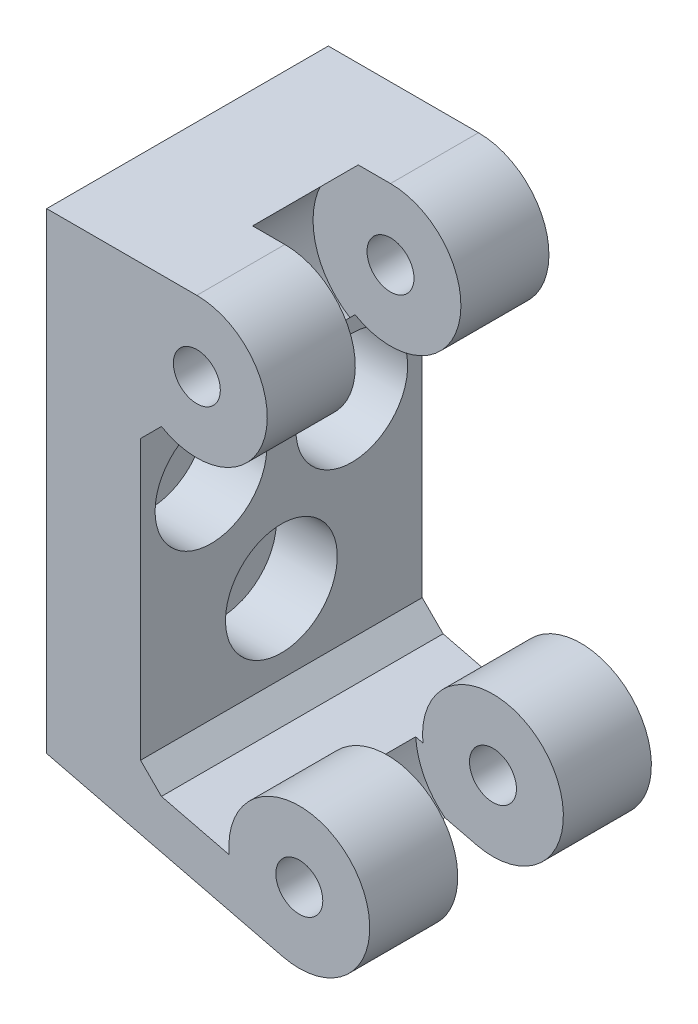
ISO-10303-21;
HEADER;
FILE_DESCRIPTION(('STEP AP214'),'2;1');
FILE_NAME('part.step','',(''),(''),'','','');
FILE_SCHEMA(('AUTOMOTIVE_DESIGN { 1 0 10303 214 1 1 1 1 }'));
ENDSEC;
DATA;
#1=APPLICATION_CONTEXT('core data for automotive mechanical design processes');
#2=APPLICATION_PROTOCOL_DEFINITION('international standard','automotive_design',2000,#1);
#3=PRODUCT_CONTEXT('',#1,'mechanical');
#4=PRODUCT('Part','Part','',(#3));
#5=PRODUCT_RELATED_PRODUCT_CATEGORY('part','',(#4));
#6=PRODUCT_DEFINITION_FORMATION('','',#4);
#7=PRODUCT_DEFINITION_CONTEXT('part definition',#1,'design');
#8=PRODUCT_DEFINITION('design','',#6,#7);
#9=PRODUCT_DEFINITION_SHAPE('','',#8);
#10=(LENGTH_UNIT() NAMED_UNIT(*) SI_UNIT(.MILLI.,.METRE.));
#11=(NAMED_UNIT(*) PLANE_ANGLE_UNIT() SI_UNIT($,.RADIAN.));
#12=(NAMED_UNIT(*) SI_UNIT($,.STERADIAN.) SOLID_ANGLE_UNIT());
#13=UNCERTAINTY_MEASURE_WITH_UNIT(LENGTH_MEASURE(1.E-05),#10,'distance_accuracy_value','');
#14=(GEOMETRIC_REPRESENTATION_CONTEXT(3) GLOBAL_UNCERTAINTY_ASSIGNED_CONTEXT((#13)) GLOBAL_UNIT_ASSIGNED_CONTEXT((#10,
#11,#12)) REPRESENTATION_CONTEXT('',''));
#15=CARTESIAN_POINT('',(0.,0.,0.));
#16=DIRECTION('',(0.,0.,1.));
#17=DIRECTION('',(1.,0.,0.));
#18=AXIS2_PLACEMENT_3D('',#15,#16,#17);
#19=CARTESIAN_POINT('',(10.7639891563292,0.450749356497164,12.));
#20=DIRECTION('',(0.,0.,-1.));
#21=DIRECTION('',(-1.,0.,0.));
#22=AXIS2_PLACEMENT_3D('',#19,#20,#21);
#23=CYLINDRICAL_SURFACE('',#22,2.99999999999828);
#24=CARTESIAN_POINT('',(10.7639891563292,0.450749356497164,3.75));
#25=DIRECTION('',(0.,0.,1.));
#26=DIRECTION('',(1.,0.,0.));
#27=AXIS2_PLACEMENT_3D('',#24,#25,#26);
#28=CIRCLE('',#27,2.99999999999828);
#29=CARTESIAN_POINT('',(10.0498839975079,-2.46302033621104,3.75));
#30=VERTEX_POINT('',#29);
#31=CARTESIAN_POINT('',(7.77882569201746,0.152757592638008,3.75));
#32=VERTEX_POINT('',#31);
#33=EDGE_CURVE('E157',#30,#32,#28,.T.);
#34=ORIENTED_EDGE('',*,*,#33,.F.);
#35=DIRECTION('',(0.,0.,-1.));
#36=VECTOR('',#35,1.);
#37=CARTESIAN_POINT('',(10.0498839975079,-2.46302033621104,12.));
#38=LINE('',#37,#36);
#39=CARTESIAN_POINT('',(10.0498839975079,-2.46302033621104,0.));
#40=VERTEX_POINT('',#39);
#41=EDGE_CURVE('E219',#30,#40,#38,.T.);
#42=ORIENTED_EDGE('',*,*,#41,.T.);
#43=CARTESIAN_POINT('',(10.7639891563292,0.450749356497164,0.));
#44=DIRECTION('',(0.,0.,1.));
#45=DIRECTION('',(1.,0.,0.));
#46=AXIS2_PLACEMENT_3D('',#43,#44,#45);
#47=CIRCLE('',#46,2.99999999999828);
#48=CARTESIAN_POINT('',(7.77882569201917,0.152757592638178,0.));
#49=VERTEX_POINT('',#48);
#50=EDGE_CURVE('E196',#40,#49,#47,.T.);
#51=ORIENTED_EDGE('',*,*,#50,.T.);
#52=DIRECTION('',(0.,0.,-1.));
#53=VECTOR('',#52,1.);
#54=CARTESIAN_POINT('',(7.77882569201917,0.152757592638178,12.));
#55=LINE('',#54,#53);
#56=EDGE_CURVE('E266',#32,#49,#55,.T.);
#57=ORIENTED_EDGE('',*,*,#56,.F.);
#58=EDGE_LOOP('',(#34,#42,#51,#57));
#59=FACE_BOUND('',#58,.T.);
#60=ADVANCED_FACE('F36',(#59),#23,.T.);
#61=CARTESIAN_POINT('',(6.39891849097926,17.1035086112948,12.));
#62=DIRECTION('',(0.,0.,-1.));
#63=DIRECTION('',(-1.,0.,0.));
#64=AXIS2_PLACEMENT_3D('',#61,#62,#63);
#65=CYLINDRICAL_SURFACE('',#64,2.99999999999656);
#66=CARTESIAN_POINT('',(6.39891849097926,17.1035086112948,3.75));
#67=DIRECTION('',(0.,0.,1.));
#68=DIRECTION('',(1.,0.,0.));
#69=AXIS2_PLACEMENT_3D('',#66,#67,#68);
#70=CIRCLE('',#69,2.99999999999656);
#71=CARTESIAN_POINT('',(4.88959841783995,14.5108356822892,3.75));
#72=VERTEX_POINT('',#71);
#73=CARTESIAN_POINT('',(6.39891849097926,20.1035086112948,3.75));
#74=VERTEX_POINT('',#73);
#75=EDGE_CURVE('E53',#72,#74,#70,.T.);
#76=ORIENTED_EDGE('',*,*,#75,.F.);
#77=DIRECTION('',(0.,0.,-1.));
#78=VECTOR('',#77,1.);
#79=CARTESIAN_POINT('',(4.88959841783995,14.5108356822892,12.));
#80=LINE('',#79,#78);
#81=CARTESIAN_POINT('',(4.88959841783995,14.5108356822892,0.));
#82=VERTEX_POINT('',#81);
#83=EDGE_CURVE('E253',#72,#82,#80,.T.);
#84=ORIENTED_EDGE('',*,*,#83,.T.);
#85=CARTESIAN_POINT('',(6.39891849097926,17.1035086112948,0.));
#86=DIRECTION('',(0.,0.,1.));
#87=DIRECTION('',(-1.,0.,0.));
#88=AXIS2_PLACEMENT_3D('',#85,#86,#87);
#89=CIRCLE('',#88,2.99999999999656);
#90=CARTESIAN_POINT('',(6.39891849097926,20.1035086112948,0.));
#91=VERTEX_POINT('',#90);
#92=EDGE_CURVE('E231',#82,#91,#89,.T.);
#93=ORIENTED_EDGE('',*,*,#92,.T.);
#94=DIRECTION('',(0.,0.,-1.));
#95=VECTOR('',#94,1.);
#96=CARTESIAN_POINT('',(6.39891849097926,20.1035086112948,12.));
#97=LINE('',#96,#95);
#98=EDGE_CURVE('E249',#74,#91,#97,.T.);
#99=ORIENTED_EDGE('',*,*,#98,.F.);
#100=EDGE_LOOP('',(#76,#84,#93,#99));
#101=FACE_BOUND('',#100,.T.);
#102=ADVANCED_FACE('F356',(#101),#65,.T.);
#103=CARTESIAN_POINT('',(6.39891849097926,17.1035086112948,12.));
#104=DIRECTION('',(0.,0.,-1.));
#105=DIRECTION('',(-1.,0.,0.));
#106=AXIS2_PLACEMENT_3D('',#103,#104,#105);
#107=CYLINDRICAL_SURFACE('',#106,1.00000000000001);
#108=CARTESIAN_POINT('',(6.39891849097926,17.1035086112948,0.));
#109=DIRECTION('',(0.,0.,1.));
#110=DIRECTION('',(1.,0.,0.));
#111=AXIS2_PLACEMENT_3D('',#108,#109,#110);
#112=CIRCLE('',#111,1.00000000000001);
#113=CARTESIAN_POINT('',(7.39891849097927,17.1035086112948,0.));
#114=VERTEX_POINT('',#113);
#115=EDGE_CURVE('E190',#114,#114,#112,.T.);
#116=ORIENTED_EDGE('',*,*,#115,.F.);
#117=EDGE_LOOP('',(#116));
#118=FACE_BOUND('',#117,.T.);
#119=CARTESIAN_POINT('',(6.39891849097926,17.1035086112948,3.75));
#120=DIRECTION('',(0.,0.,1.));
#121=DIRECTION('',(1.,0.,0.));
#122=AXIS2_PLACEMENT_3D('',#119,#120,#121);
#123=CIRCLE('',#122,1.00000000000001);
#124=CARTESIAN_POINT('',(7.39891849097927,17.1035086112948,3.75));
#125=VERTEX_POINT('',#124);
#126=EDGE_CURVE('E277',#125,#125,#123,.T.);
#127=ORIENTED_EDGE('',*,*,#126,.T.);
#128=EDGE_LOOP('',(#127));
#129=FACE_BOUND('',#128,.T.);
#130=ADVANCED_FACE('F405',(#118,#129),#107,.F.);
#131=CARTESIAN_POINT('',(10.7639891563292,0.450749356497164,12.));
#132=DIRECTION('',(0.,0.,-1.));
#133=DIRECTION('',(-1.,0.,0.));
#134=AXIS2_PLACEMENT_3D('',#131,#132,#133);
#135=CYLINDRICAL_SURFACE('',#134,0.999999999999998);
#136=CARTESIAN_POINT('',(10.7639891563292,0.450749356497164,0.));
#137=DIRECTION('',(0.,0.,1.));
#138=DIRECTION('',(1.,0.,0.));
#139=AXIS2_PLACEMENT_3D('',#136,#137,#138);
#140=CIRCLE('',#139,0.999999999999998);
#141=CARTESIAN_POINT('',(11.7639891563292,0.450749356497164,0.));
#142=VERTEX_POINT('',#141);
#143=EDGE_CURVE('E180',#142,#142,#140,.T.);
#144=ORIENTED_EDGE('',*,*,#143,.F.);
#145=EDGE_LOOP('',(#144));
#146=FACE_BOUND('',#145,.T.);
#147=CARTESIAN_POINT('',(10.7639891563292,0.450749356497164,3.75));
#148=DIRECTION('',(0.,0.,1.));
#149=DIRECTION('',(1.,0.,0.));
#150=AXIS2_PLACEMENT_3D('',#147,#148,#149);
#151=CIRCLE('',#150,0.999999999999998);
#152=CARTESIAN_POINT('',(11.7639891563292,0.450749356497164,3.75));
#153=VERTEX_POINT('',#152);
#154=EDGE_CURVE('E269',#153,#153,#151,.T.);
#155=ORIENTED_EDGE('',*,*,#154,.T.);
#156=EDGE_LOOP('',(#155));
#157=FACE_BOUND('',#156,.T.);
#158=ADVANCED_FACE('F416',(#146,#157),#135,.F.);
#159=CARTESIAN_POINT('',(10.7639891563292,0.450749356497164,12.));
#160=DIRECTION('',(0.,0.,1.));
#161=DIRECTION('',(1.,0.,0.));
#162=AXIS2_PLACEMENT_3D('',#159,#160,#161);
#163=PLANE('',#162);
#164=CARTESIAN_POINT('',(6.39891849097926,17.1035086112948,12.));
#165=DIRECTION('',(0.,0.,1.));
#166=DIRECTION('',(1.,0.,0.));
#167=AXIS2_PLACEMENT_3D('',#164,#165,#166);
#168=CIRCLE('',#167,1.00000000000001);
#169=CARTESIAN_POINT('',(7.39891849097927,17.1035086112948,12.));
#170=VERTEX_POINT('',#169);
#171=EDGE_CURVE('E193',#170,#170,#168,.T.);
#172=ORIENTED_EDGE('',*,*,#171,.F.);
#173=EDGE_LOOP('',(#172));
#174=FACE_BOUND('',#173,.T.);
#175=CARTESIAN_POINT('',(10.7639891563292,0.450749356497164,12.));
#176=DIRECTION('',(0.,0.,1.));
#177=DIRECTION('',(1.,0.,0.));
#178=AXIS2_PLACEMENT_3D('',#175,#176,#177);
#179=CIRCLE('',#178,2.99999999999828);
#180=CARTESIAN_POINT('',(10.0498839975079,-2.46302033621104,12.));
#181=VERTEX_POINT('',#180);
#182=CARTESIAN_POINT('',(7.77882569201917,0.152757592638178,12.));
#183=VERTEX_POINT('',#182);
#184=EDGE_CURVE('E199',#181,#183,#179,.T.);
#185=ORIENTED_EDGE('',*,*,#184,.T.);
#186=DIRECTION('',(-0.971256564236068,0.238035052940422,0.));
#187=VECTOR('',#186,1.);
#188=CARTESIAN_POINT('',(4.88959841784168,0.860847908307429,12.));
#189=LINE('',#188,#187);
#190=CARTESIAN_POINT('',(4.88959841784168,0.860847908307429,12.));
#191=VERTEX_POINT('',#190);
#192=EDGE_CURVE('E202',#183,#191,#189,.T.);
#193=ORIENTED_EDGE('',*,*,#192,.T.);
#194=DIRECTION('',(-0.707106781186549,0.707106781186546,0.));
#195=VECTOR('',#194,1.);
#196=CARTESIAN_POINT('',(4.,1.7504463261491,12.));
#197=LINE('',#196,#195);
#198=CARTESIAN_POINT('',(4.,1.7504463261491,12.));
#199=VERTEX_POINT('',#198);
#200=EDGE_CURVE('E205',#191,#199,#197,.T.);
#201=ORIENTED_EDGE('',*,*,#200,.T.);
#202=DIRECTION('',(0.,1.,0.));
#203=VECTOR('',#202,1.);
#204=CARTESIAN_POINT('',(4.,13.6212372644505,12.));
#205=LINE('',#204,#203);
#206=CARTESIAN_POINT('',(4.,13.6212372644505,12.));
#207=VERTEX_POINT('',#206);
#208=EDGE_CURVE('E207',#199,#207,#205,.T.);
#209=ORIENTED_EDGE('',*,*,#208,.T.);
#210=DIRECTION('',(0.707106781186549,0.707106781186546,0.));
#211=VECTOR('',#210,1.);
#212=CARTESIAN_POINT('',(4.88959841784167,14.5108356822922,12.));
#213=LINE('',#212,#211);
#214=CARTESIAN_POINT('',(4.88959841783995,14.5108356822892,12.));
#215=VERTEX_POINT('',#214);
#216=EDGE_CURVE('E209',#207,#215,#213,.T.);
#217=ORIENTED_EDGE('',*,*,#216,.T.);
#218=CARTESIAN_POINT('',(6.39891849097926,17.1035086112948,12.));
#219=DIRECTION('',(0.,0.,1.));
#220=DIRECTION('',(-1.,0.,0.));
#221=AXIS2_PLACEMENT_3D('',#218,#219,#220);
#222=CIRCLE('',#221,2.99999999999656);
#223=CARTESIAN_POINT('',(6.39891849097926,20.1035086112948,12.));
#224=VERTEX_POINT('',#223);
#225=EDGE_CURVE('E211',#215,#224,#222,.T.);
#226=ORIENTED_EDGE('',*,*,#225,.T.);
#227=DIRECTION('',(-1.,0.,0.));
#228=VECTOR('',#227,1.);
#229=CARTESIAN_POINT('',(0.,20.1035086112948,12.));
#230=LINE('',#229,#228);
#231=CARTESIAN_POINT('',(0.,20.1035086112948,12.));
#232=VERTEX_POINT('',#231);
#233=EDGE_CURVE('E213',#224,#232,#230,.T.);
#234=ORIENTED_EDGE('',*,*,#233,.T.);
#235=DIRECTION('',(0.,-1.,0.));
#236=VECTOR('',#235,1.);
#237=CARTESIAN_POINT('',(0.,0.,12.));
#238=LINE('',#237,#236);
#239=CARTESIAN_POINT('',(0.,0.,12.));
#240=VERTEX_POINT('',#239);
#241=EDGE_CURVE('E215',#232,#240,#238,.T.);
#242=ORIENTED_EDGE('',*,*,#241,.T.);
#243=DIRECTION('',(0.971256564236068,-0.238035052940421,0.));
#244=VECTOR('',#243,1.);
#245=CARTESIAN_POINT('',(0.,0.,12.));
#246=LINE('',#245,#244);
#247=EDGE_CURVE('E217',#240,#181,#246,.T.);
#248=ORIENTED_EDGE('',*,*,#247,.T.);
#249=EDGE_LOOP('',(#185,#193,#201,#209,#217,#226,#234,#242,#248));
#250=FACE_BOUND('',#249,.T.);
#251=CARTESIAN_POINT('',(10.7639891563292,0.450749356497164,12.));
#252=DIRECTION('',(0.,0.,1.));
#253=DIRECTION('',(1.,0.,0.));
#254=AXIS2_PLACEMENT_3D('',#251,#252,#253);
#255=CIRCLE('',#254,0.999999999999998);
#256=CARTESIAN_POINT('',(11.7639891563292,0.450749356497164,12.));
#257=VERTEX_POINT('',#256);
#258=EDGE_CURVE('E187',#257,#257,#255,.T.);
#259=ORIENTED_EDGE('',*,*,#258,.F.);
#260=EDGE_LOOP('',(#259));
#261=FACE_BOUND('',#260,.T.);
#262=ADVANCED_FACE('F339',(#174,#250,#261),#163,.T.);
#263=CARTESIAN_POINT('',(10.7639891563292,0.450749356497164,0.));
#264=DIRECTION('',(0.,0.,1.));
#265=DIRECTION('',(1.,0.,0.));
#266=AXIS2_PLACEMENT_3D('',#263,#264,#265);
#267=PLANE('',#266);
#268=ORIENTED_EDGE('',*,*,#50,.F.);
#269=DIRECTION('',(0.971256564236068,-0.238035052940421,0.));
#270=VECTOR('',#269,1.);
#271=CARTESIAN_POINT('',(0.,0.,0.));
#272=LINE('',#271,#270);
#273=CARTESIAN_POINT('',(0.,0.,0.));
#274=VERTEX_POINT('',#273);
#275=EDGE_CURVE('E203',#274,#40,#272,.T.);
#276=ORIENTED_EDGE('',*,*,#275,.F.);
#277=DIRECTION('',(0.,-1.,0.));
#278=VECTOR('',#277,1.);
#279=CARTESIAN_POINT('',(0.,0.,0.));
#280=LINE('',#279,#278);
#281=CARTESIAN_POINT('',(0.,20.1035086112948,0.));
#282=VERTEX_POINT('',#281);
#283=EDGE_CURVE('E236',#282,#274,#280,.T.);
#284=ORIENTED_EDGE('',*,*,#283,.F.);
#285=DIRECTION('',(-1.,0.,0.));
#286=VECTOR('',#285,1.);
#287=CARTESIAN_POINT('',(0.,20.1035086112948,0.));
#288=LINE('',#287,#286);
#289=EDGE_CURVE('E234',#91,#282,#288,.T.);
#290=ORIENTED_EDGE('',*,*,#289,.F.);
#291=ORIENTED_EDGE('',*,*,#92,.F.);
#292=DIRECTION('',(0.707106781186549,0.707106781186546,0.));
#293=VECTOR('',#292,1.);
#294=CARTESIAN_POINT('',(4.88959841784167,14.5108356822922,0.));
#295=LINE('',#294,#293);
#296=CARTESIAN_POINT('',(4.,13.6212372644505,0.));
#297=VERTEX_POINT('',#296);
#298=EDGE_CURVE('E228',#297,#82,#295,.T.);
#299=ORIENTED_EDGE('',*,*,#298,.F.);
#300=DIRECTION('',(0.,1.,0.));
#301=VECTOR('',#300,1.);
#302=CARTESIAN_POINT('',(4.,13.6212372644505,0.));
#303=LINE('',#302,#301);
#304=CARTESIAN_POINT('',(4.,1.7504463261491,0.));
#305=VERTEX_POINT('',#304);
#306=EDGE_CURVE('E226',#305,#297,#303,.T.);
#307=ORIENTED_EDGE('',*,*,#306,.F.);
#308=DIRECTION('',(-0.707106781186549,0.707106781186546,0.));
#309=VECTOR('',#308,1.);
#310=CARTESIAN_POINT('',(4.,1.7504463261491,0.));
#311=LINE('',#310,#309);
#312=CARTESIAN_POINT('',(4.88959841784168,0.860847908307429,0.));
#313=VERTEX_POINT('',#312);
#314=EDGE_CURVE('E224',#313,#305,#311,.T.);
#315=ORIENTED_EDGE('',*,*,#314,.F.);
#316=DIRECTION('',(-0.971256564236068,0.238035052940422,0.));
#317=VECTOR('',#316,1.);
#318=CARTESIAN_POINT('',(4.88959841784168,0.860847908307429,0.));
#319=LINE('',#318,#317);
#320=EDGE_CURVE('E222',#49,#313,#319,.T.);
#321=ORIENTED_EDGE('',*,*,#320,.F.);
#322=EDGE_LOOP('',(#268,#276,#284,#290,#291,#299,#307,#315,#321));
#323=FACE_BOUND('',#322,.T.);
#324=ORIENTED_EDGE('',*,*,#115,.T.);
#325=EDGE_LOOP('',(#324));
#326=FACE_BOUND('',#325,.T.);
#327=ORIENTED_EDGE('',*,*,#143,.T.);
#328=EDGE_LOOP('',(#327));
#329=FACE_BOUND('',#328,.T.);
#330=ADVANCED_FACE('F364',(#323,#326,#329),#267,.F.);
#331=CARTESIAN_POINT('',(10.0498839975079,-2.46302033621104,8.25));
#332=VERTEX_POINT('',#331);
#333=EDGE_CURVE('E240',#181,#332,#38,.T.);
#334=ORIENTED_EDGE('',*,*,#333,.T.);
#335=CARTESIAN_POINT('',(10.7639891563292,0.450749356497164,8.25));
#336=DIRECTION('',(0.,0.,1.));
#337=DIRECTION('',(1.,0.,0.));
#338=AXIS2_PLACEMENT_3D('',#335,#336,#337);
#339=CIRCLE('',#338,2.99999999999828);
#340=CARTESIAN_POINT('',(7.77882569201746,0.152757592638008,8.25));
#341=VERTEX_POINT('',#340);
#342=EDGE_CURVE('E317',#332,#341,#339,.T.);
#343=ORIENTED_EDGE('',*,*,#342,.T.);
#344=EDGE_CURVE('E267',#183,#341,#55,.T.);
#345=ORIENTED_EDGE('',*,*,#344,.F.);
#346=ORIENTED_EDGE('',*,*,#184,.F.);
#347=EDGE_LOOP('',(#334,#343,#345,#346));
#348=FACE_BOUND('',#347,.T.);
#349=ADVANCED_FACE('F38',(#348),#23,.T.);
#350=CARTESIAN_POINT('',(4.88959841784168,0.860847908307429,12.));
#351=DIRECTION('',(-0.238035052940422,-0.971256564236068,0.));
#352=DIRECTION('',(0.971256564236068,-0.238035052940422,0.));
#353=AXIS2_PLACEMENT_3D('',#350,#351,#352);
#354=PLANE('',#353);
#355=ORIENTED_EDGE('',*,*,#344,.T.);
#356=DIRECTION('',(-0.971256564236068,0.238035052940422,0.));
#357=VECTOR('',#356,1.);
#358=CARTESIAN_POINT('',(4.88959841784168,0.860847908307429,8.25));
#359=LINE('',#358,#357);
#360=CARTESIAN_POINT('',(7.47151048609546,0.22807424325869,8.25));
#361=VERTEX_POINT('',#360);
#362=EDGE_CURVE('E176',#341,#361,#359,.T.);
#363=ORIENTED_EDGE('',*,*,#362,.T.);
#364=DIRECTION('',(0.,0.,-1.));
#365=VECTOR('',#364,1.);
#366=CARTESIAN_POINT('',(7.47151048609546,0.22807424325869,8.25));
#367=LINE('',#366,#365);
#368=CARTESIAN_POINT('',(7.47151048609546,0.22807424325869,3.75));
#369=VERTEX_POINT('',#368);
#370=EDGE_CURVE('E166',#369,#361,#367,.F.);
#371=ORIENTED_EDGE('',*,*,#370,.F.);
#372=DIRECTION('',(-0.971256564236068,0.238035052940422,0.));
#373=VECTOR('',#372,1.);
#374=CARTESIAN_POINT('',(4.88959841784168,0.860847908307429,3.75));
#375=LINE('',#374,#373);
#376=EDGE_CURVE('E154',#32,#369,#375,.T.);
#377=ORIENTED_EDGE('',*,*,#376,.F.);
#378=ORIENTED_EDGE('',*,*,#56,.T.);
#379=ORIENTED_EDGE('',*,*,#320,.T.);
#380=DIRECTION('',(0.,0.,-1.));
#381=VECTOR('',#380,1.);
#382=CARTESIAN_POINT('',(4.88959841784168,0.860847908307429,12.));
#383=LINE('',#382,#381);
#384=EDGE_CURVE('E263',#191,#313,#383,.T.);
#385=ORIENTED_EDGE('',*,*,#384,.F.);
#386=ORIENTED_EDGE('',*,*,#192,.F.);
#387=EDGE_LOOP('',(#355,#363,#371,#377,#378,#379,#385,#386));
#388=FACE_BOUND('',#387,.T.);
#389=ADVANCED_FACE('F175',(#388),#354,.F.);
#390=CARTESIAN_POINT('',(4.,1.7504463261491,12.));
#391=DIRECTION('',(-0.707106781186546,-0.707106781186549,0.));
#392=DIRECTION('',(0.707106781186549,-0.707106781186546,0.));
#393=AXIS2_PLACEMENT_3D('',#390,#391,#392);
#394=PLANE('',#393);
#395=ORIENTED_EDGE('',*,*,#314,.T.);
#396=DIRECTION('',(0.,0.,-1.));
#397=VECTOR('',#396,1.);
#398=CARTESIAN_POINT('',(4.,1.7504463261491,12.));
#399=LINE('',#398,#397);
#400=EDGE_CURVE('E260',#199,#305,#399,.T.);
#401=ORIENTED_EDGE('',*,*,#400,.F.);
#402=ORIENTED_EDGE('',*,*,#200,.F.);
#403=ORIENTED_EDGE('',*,*,#384,.T.);
#404=EDGE_LOOP('',(#395,#401,#402,#403));
#405=FACE_BOUND('',#404,.T.);
#406=ADVANCED_FACE('F382',(#405),#394,.F.);
#407=CARTESIAN_POINT('',(4.,13.6212372644505,12.));
#408=DIRECTION('',(-1.,0.,0.));
#409=DIRECTION('',(0.,-1.,0.));
#410=AXIS2_PLACEMENT_3D('',#407,#408,#409);
#411=PLANE('',#410);
#412=CARTESIAN_POINT('',(4.00000000000001,5.08957787179198,6.));
#413=DIRECTION('',(-1.,0.,0.));
#414=DIRECTION('',(0.,0.,1.));
#415=AXIS2_PLACEMENT_3D('',#412,#413,#414);
#416=CIRCLE('',#415,2.38125);
#417=CARTESIAN_POINT('',(4.00000000000001,5.08957787179198,8.38125));
#418=VERTEX_POINT('',#417);
#419=EDGE_CURVE('E748',#418,#418,#416,.T.);
#420=ORIENTED_EDGE('',*,*,#419,.T.);
#421=EDGE_LOOP('',(#420));
#422=FACE_BOUND('',#421,.T.);
#423=CARTESIAN_POINT('',(4.00000000000001,10.6212372644505,9.));
#424=DIRECTION('',(-1.,0.,0.));
#425=DIRECTION('',(0.,0.,1.));
#426=AXIS2_PLACEMENT_3D('',#423,#424,#425);
#427=CIRCLE('',#426,2.38125);
#428=CARTESIAN_POINT('',(4.00000000000001,10.6212372644505,11.38125));
#429=VERTEX_POINT('',#428);
#430=EDGE_CURVE('E749',#429,#429,#427,.T.);
#431=ORIENTED_EDGE('',*,*,#430,.T.);
#432=EDGE_LOOP('',(#431));
#433=FACE_BOUND('',#432,.T.);
#434=CARTESIAN_POINT('',(4.00000000000001,10.6212372644505,3.));
#435=DIRECTION('',(-1.,0.,0.));
#436=DIRECTION('',(0.,0.,1.));
#437=AXIS2_PLACEMENT_3D('',#434,#435,#436);
#438=CIRCLE('',#437,2.38125);
#439=CARTESIAN_POINT('',(4.00000000000001,10.6212372644505,5.38125));
#440=VERTEX_POINT('',#439);
#441=EDGE_CURVE('E758',#440,#440,#438,.T.);
#442=ORIENTED_EDGE('',*,*,#441,.T.);
#443=EDGE_LOOP('',(#442));
#444=FACE_BOUND('',#443,.T.);
#445=ORIENTED_EDGE('',*,*,#306,.T.);
#446=DIRECTION('',(0.,0.,-1.));
#447=VECTOR('',#446,1.);
#448=CARTESIAN_POINT('',(4.,13.6212372644505,12.));
#449=LINE('',#448,#447);
#450=EDGE_CURVE('E257',#207,#297,#449,.T.);
#451=ORIENTED_EDGE('',*,*,#450,.F.);
#452=ORIENTED_EDGE('',*,*,#208,.F.);
#453=ORIENTED_EDGE('',*,*,#400,.T.);
#454=EDGE_LOOP('',(#445,#451,#452,#453));
#455=FACE_BOUND('',#454,.T.);
#456=ADVANCED_FACE('F385',(#422,#433,#444,#455),#411,.F.);
#457=CARTESIAN_POINT('',(4.88959841784167,14.5108356822922,12.));
#458=DIRECTION('',(-0.707106781186546,0.707106781186549,0.));
#459=DIRECTION('',(-0.707106781186549,-0.707106781186546,0.));
#460=AXIS2_PLACEMENT_3D('',#457,#458,#459);
#461=PLANE('',#460);
#462=DIRECTION('',(0.,0.,-1.));
#463=VECTOR('',#462,1.);
#464=CARTESIAN_POINT('',(4.6708842220558,14.2921214865063,8.25));
#465=LINE('',#464,#463);
#466=CARTESIAN_POINT('',(4.6708842220558,14.2921214865063,8.25));
#467=VERTEX_POINT('',#466);
#468=CARTESIAN_POINT('',(4.6708842220558,14.2921214865063,3.75));
#469=VERTEX_POINT('',#468);
#470=EDGE_CURVE('E177',#467,#469,#465,.T.);
#471=ORIENTED_EDGE('',*,*,#470,.F.);
#472=DIRECTION('',(0.707106781186549,0.707106781186546,0.));
#473=VECTOR('',#472,1.);
#474=CARTESIAN_POINT('',(4.88959841784167,14.5108356822922,8.25));
#475=LINE('',#474,#473);
#476=CARTESIAN_POINT('',(4.88959841783995,14.5108356822892,8.25));
#477=VERTEX_POINT('',#476);
#478=EDGE_CURVE('E178',#467,#477,#475,.T.);
#479=ORIENTED_EDGE('',*,*,#478,.T.);
#480=EDGE_CURVE('E254',#215,#477,#80,.T.);
#481=ORIENTED_EDGE('',*,*,#480,.F.);
#482=ORIENTED_EDGE('',*,*,#216,.F.);
#483=ORIENTED_EDGE('',*,*,#450,.T.);
#484=ORIENTED_EDGE('',*,*,#298,.T.);
#485=ORIENTED_EDGE('',*,*,#83,.F.);
#486=DIRECTION('',(0.707106781186549,0.707106781186546,0.));
#487=VECTOR('',#486,1.);
#488=CARTESIAN_POINT('',(4.88959841784167,14.5108356822922,3.75));
#489=LINE('',#488,#487);
#490=EDGE_CURVE('E285',#469,#72,#489,.T.);
#491=ORIENTED_EDGE('',*,*,#490,.F.);
#492=EDGE_LOOP('',(#471,#479,#481,#482,#483,#484,#485,#491));
#493=FACE_BOUND('',#492,.T.);
#494=ADVANCED_FACE('F347',(#493),#461,.F.);
#495=ORIENTED_EDGE('',*,*,#480,.T.);
#496=CARTESIAN_POINT('',(6.39891849097926,17.1035086112948,8.25));
#497=DIRECTION('',(0.,0.,1.));
#498=DIRECTION('',(1.,0.,0.));
#499=AXIS2_PLACEMENT_3D('',#496,#497,#498);
#500=CIRCLE('',#499,2.99999999999656);
#501=CARTESIAN_POINT('',(6.39891849097926,20.1035086112948,8.25));
#502=VERTEX_POINT('',#501);
#503=EDGE_CURVE('E183',#477,#502,#500,.T.);
#504=ORIENTED_EDGE('',*,*,#503,.T.);
#505=EDGE_CURVE('E250',#224,#502,#97,.T.);
#506=ORIENTED_EDGE('',*,*,#505,.F.);
#507=ORIENTED_EDGE('',*,*,#225,.F.);
#508=EDGE_LOOP('',(#495,#504,#506,#507));
#509=FACE_BOUND('',#508,.T.);
#510=ADVANCED_FACE('F328',(#509),#65,.T.);
#511=CARTESIAN_POINT('',(0.,20.1035086112948,12.));
#512=DIRECTION('',(0.,-1.,0.));
#513=DIRECTION('',(1.,0.,0.));
#514=AXIS2_PLACEMENT_3D('',#511,#512,#513);
#515=PLANE('',#514);
#516=ORIENTED_EDGE('',*,*,#505,.T.);
#517=DIRECTION('',(-1.,0.,0.));
#518=VECTOR('',#517,1.);
#519=CARTESIAN_POINT('',(0.,20.1035086112948,8.25));
#520=LINE('',#519,#518);
#521=CARTESIAN_POINT('',(5.0241457824925,20.1035086112948,8.25));
#522=VERTEX_POINT('',#521);
#523=EDGE_CURVE('E284',#502,#522,#520,.T.);
#524=ORIENTED_EDGE('',*,*,#523,.T.);
#525=DIRECTION('',(0.,0.,-1.));
#526=VECTOR('',#525,1.);
#527=CARTESIAN_POINT('',(5.0241457824925,20.1035086112948,8.25));
#528=LINE('',#527,#526);
#529=CARTESIAN_POINT('',(5.0241457824925,20.1035086112948,3.75));
#530=VERTEX_POINT('',#529);
#531=EDGE_CURVE('E11',#530,#522,#528,.F.);
#532=ORIENTED_EDGE('',*,*,#531,.F.);
#533=DIRECTION('',(-1.,0.,0.));
#534=VECTOR('',#533,1.);
#535=CARTESIAN_POINT('',(0.,20.1035086112948,3.75));
#536=LINE('',#535,#534);
#537=EDGE_CURVE('E280',#74,#530,#536,.T.);
#538=ORIENTED_EDGE('',*,*,#537,.F.);
#539=ORIENTED_EDGE('',*,*,#98,.T.);
#540=ORIENTED_EDGE('',*,*,#289,.T.);
#541=DIRECTION('',(0.,0.,-1.));
#542=VECTOR('',#541,1.);
#543=CARTESIAN_POINT('',(0.,20.1035086112948,12.));
#544=LINE('',#543,#542);
#545=EDGE_CURVE('E246',#232,#282,#544,.T.);
#546=ORIENTED_EDGE('',*,*,#545,.F.);
#547=ORIENTED_EDGE('',*,*,#233,.F.);
#548=EDGE_LOOP('',(#516,#524,#532,#538,#539,#540,#546,#547));
#549=FACE_BOUND('',#548,.T.);
#550=ADVANCED_FACE('F334',(#549),#515,.F.);
#551=CARTESIAN_POINT('',(0.,0.,12.));
#552=DIRECTION('',(1.,0.,0.));
#553=DIRECTION('',(0.,0.,-1.));
#554=AXIS2_PLACEMENT_3D('',#551,#552,#553);
#555=PLANE('',#554);
#556=CARTESIAN_POINT('',(0.,10.6212372644505,9.));
#557=DIRECTION('',(-1.,0.,0.));
#558=DIRECTION('',(0.,0.,1.));
#559=AXIS2_PLACEMENT_3D('',#556,#557,#558);
#560=CIRCLE('',#559,1.28840579710145);
#561=CARTESIAN_POINT('',(0.,10.6212372644505,10.2884057971015));
#562=VERTEX_POINT('',#561);
#563=EDGE_CURVE('E171',#562,#562,#560,.T.);
#564=ORIENTED_EDGE('',*,*,#563,.F.);
#565=EDGE_LOOP('',(#564));
#566=FACE_BOUND('',#565,.T.);
#567=CARTESIAN_POINT('',(0.,10.6212372644505,3.));
#568=DIRECTION('',(-1.,0.,0.));
#569=DIRECTION('',(0.,0.,1.));
#570=AXIS2_PLACEMENT_3D('',#567,#568,#569);
#571=CIRCLE('',#570,1.28840579710145);
#572=CARTESIAN_POINT('',(0.,10.6212372644505,4.28840579710145));
#573=VERTEX_POINT('',#572);
#574=EDGE_CURVE('E299',#573,#573,#571,.T.);
#575=ORIENTED_EDGE('',*,*,#574,.F.);
#576=EDGE_LOOP('',(#575));
#577=FACE_BOUND('',#576,.T.);
#578=CARTESIAN_POINT('',(0.,5.08957787179198,6.));
#579=DIRECTION('',(-1.,0.,0.));
#580=DIRECTION('',(0.,0.,1.));
#581=AXIS2_PLACEMENT_3D('',#578,#579,#580);
#582=CIRCLE('',#581,1.28840579710145);
#583=CARTESIAN_POINT('',(0.,5.08957787179198,7.28840579710145));
#584=VERTEX_POINT('',#583);
#585=EDGE_CURVE('E295',#584,#584,#582,.T.);
#586=ORIENTED_EDGE('',*,*,#585,.F.);
#587=EDGE_LOOP('',(#586));
#588=FACE_BOUND('',#587,.T.);
#589=ORIENTED_EDGE('',*,*,#283,.T.);
#590=DIRECTION('',(0.,0.,-1.));
#591=VECTOR('',#590,1.);
#592=CARTESIAN_POINT('',(0.,0.,12.));
#593=LINE('',#592,#591);
#594=EDGE_CURVE('E243',#240,#274,#593,.T.);
#595=ORIENTED_EDGE('',*,*,#594,.F.);
#596=ORIENTED_EDGE('',*,*,#241,.F.);
#597=ORIENTED_EDGE('',*,*,#545,.T.);
#598=EDGE_LOOP('',(#589,#595,#596,#597));
#599=FACE_BOUND('',#598,.T.);
#600=ADVANCED_FACE('F368',(#566,#577,#588,#599),#555,.F.);
#601=CARTESIAN_POINT('',(0.,0.,12.));
#602=DIRECTION('',(0.238035052940421,0.971256564236068,0.));
#603=DIRECTION('',(-0.971256564236068,0.238035052940421,0.));
#604=AXIS2_PLACEMENT_3D('',#601,#602,#603);
#605=PLANE('',#604);
#606=DIRECTION('',(0.,0.,-1.));
#607=VECTOR('',#606,1.);
#608=CARTESIAN_POINT('',(8.71462698005759,-2.13577624176535,8.25));
#609=LINE('',#608,#607);
#610=CARTESIAN_POINT('',(8.71462698005759,-2.13577624176535,8.25));
#611=VERTEX_POINT('',#610);
#612=CARTESIAN_POINT('',(8.71462698005759,-2.13577624176535,3.75));
#613=VERTEX_POINT('',#612);
#614=EDGE_CURVE('E45',#611,#613,#609,.T.);
#615=ORIENTED_EDGE('',*,*,#614,.F.);
#616=DIRECTION('',(0.971256564236068,-0.238035052940421,0.));
#617=VECTOR('',#616,1.);
#618=CARTESIAN_POINT('',(0.,0.,8.25));
#619=LINE('',#618,#617);
#620=EDGE_CURVE('E276',#611,#332,#619,.T.);
#621=ORIENTED_EDGE('',*,*,#620,.T.);
#622=ORIENTED_EDGE('',*,*,#333,.F.);
#623=ORIENTED_EDGE('',*,*,#247,.F.);
#624=ORIENTED_EDGE('',*,*,#594,.T.);
#625=ORIENTED_EDGE('',*,*,#275,.T.);
#626=ORIENTED_EDGE('',*,*,#41,.F.);
#627=DIRECTION('',(0.971256564236068,-0.238035052940421,0.));
#628=VECTOR('',#627,1.);
#629=CARTESIAN_POINT('',(0.,0.,3.75));
#630=LINE('',#629,#628);
#631=EDGE_CURVE('E272',#613,#30,#630,.T.);
#632=ORIENTED_EDGE('',*,*,#631,.F.);
#633=EDGE_LOOP('',(#615,#621,#622,#623,#624,#625,#626,#632));
#634=FACE_BOUND('',#633,.T.);
#635=ADVANCED_FACE('F372',(#634),#605,.F.);
#636=CARTESIAN_POINT('',(6.39891849097926,17.1035086112948,8.25));
#637=DIRECTION('',(0.,0.,1.));
#638=DIRECTION('',(1.,0.,0.));
#639=AXIS2_PLACEMENT_3D('',#636,#637,#638);
#640=CIRCLE('',#639,1.00000000000001);
#641=CARTESIAN_POINT('',(7.39891849097927,17.1035086112948,8.25));
#642=VERTEX_POINT('',#641);
#643=EDGE_CURVE('E281',#642,#642,#640,.T.);
#644=ORIENTED_EDGE('',*,*,#643,.F.);
#645=EDGE_LOOP('',(#644));
#646=FACE_BOUND('',#645,.T.);
#647=ORIENTED_EDGE('',*,*,#171,.T.);
#648=EDGE_LOOP('',(#647));
#649=FACE_BOUND('',#648,.T.);
#650=ADVANCED_FACE('F423',(#646,#649),#107,.F.);
#651=CARTESIAN_POINT('',(10.7639891563292,0.450749356497164,8.25));
#652=DIRECTION('',(0.,0.,1.));
#653=DIRECTION('',(1.,0.,0.));
#654=AXIS2_PLACEMENT_3D('',#651,#652,#653);
#655=CIRCLE('',#654,0.999999999999998);
#656=CARTESIAN_POINT('',(11.7639891563292,0.450749356497164,8.25));
#657=VERTEX_POINT('',#656);
#658=EDGE_CURVE('E161',#657,#657,#655,.T.);
#659=ORIENTED_EDGE('',*,*,#658,.F.);
#660=EDGE_LOOP('',(#659));
#661=FACE_BOUND('',#660,.T.);
#662=ORIENTED_EDGE('',*,*,#258,.T.);
#663=EDGE_LOOP('',(#662));
#664=FACE_BOUND('',#663,.T.);
#665=ADVANCED_FACE('F399',(#661,#664),#135,.F.);
#666=CARTESIAN_POINT('',(10.7639891563292,0.450749356497164,8.25));
#667=DIRECTION('',(0.,0.,-1.));
#668=DIRECTION('',(-1.,0.,0.));
#669=AXIS2_PLACEMENT_3D('',#666,#667,#668);
#670=CYLINDRICAL_SURFACE('',#669,3.3);
#671=ORIENTED_EDGE('',*,*,#370,.T.);
#672=CARTESIAN_POINT('',(10.7639891563292,0.450749356497164,8.25));
#673=DIRECTION('',(0.,0.,1.));
#674=DIRECTION('',(1.,0.,0.));
#675=AXIS2_PLACEMENT_3D('',#672,#673,#674);
#676=CIRCLE('',#675,3.3);
#677=EDGE_CURVE('E170',#361,#611,#676,.T.);
#678=ORIENTED_EDGE('',*,*,#677,.T.);
#679=ORIENTED_EDGE('',*,*,#614,.T.);
#680=CARTESIAN_POINT('',(10.7639891563292,0.450749356497164,3.75));
#681=DIRECTION('',(0.,0.,1.));
#682=DIRECTION('',(1.,0.,0.));
#683=AXIS2_PLACEMENT_3D('',#680,#681,#682);
#684=CIRCLE('',#683,3.3);
#685=EDGE_CURVE('E61',#369,#613,#684,.T.);
#686=ORIENTED_EDGE('',*,*,#685,.F.);
#687=EDGE_LOOP('',(#671,#678,#679,#686));
#688=FACE_BOUND('',#687,.T.);
#689=ADVANCED_FACE('F164',(#688),#670,.F.);
#690=CARTESIAN_POINT('',(10.7639891563292,0.450749356497164,8.25));
#691=DIRECTION('',(0.,0.,1.));
#692=DIRECTION('',(1.,0.,0.));
#693=AXIS2_PLACEMENT_3D('',#690,#691,#692);
#694=PLANE('',#693);
#695=ORIENTED_EDGE('',*,*,#658,.T.);
#696=EDGE_LOOP('',(#695));
#697=FACE_BOUND('',#696,.T.);
#698=ORIENTED_EDGE('',*,*,#342,.F.);
#699=ORIENTED_EDGE('',*,*,#620,.F.);
#700=ORIENTED_EDGE('',*,*,#677,.F.);
#701=ORIENTED_EDGE('',*,*,#362,.F.);
#702=EDGE_LOOP('',(#698,#699,#700,#701));
#703=FACE_BOUND('',#702,.T.);
#704=ADVANCED_FACE('F389',(#697,#703),#694,.F.);
#705=CARTESIAN_POINT('',(10.7639891563292,0.450749356497164,3.75));
#706=DIRECTION('',(0.,0.,1.));
#707=DIRECTION('',(1.,0.,0.));
#708=AXIS2_PLACEMENT_3D('',#705,#706,#707);
#709=PLANE('',#708);
#710=ORIENTED_EDGE('',*,*,#154,.F.);
#711=EDGE_LOOP('',(#710));
#712=FACE_BOUND('',#711,.T.);
#713=ORIENTED_EDGE('',*,*,#376,.T.);
#714=ORIENTED_EDGE('',*,*,#685,.T.);
#715=ORIENTED_EDGE('',*,*,#631,.T.);
#716=ORIENTED_EDGE('',*,*,#33,.T.);
#717=EDGE_LOOP('',(#713,#714,#715,#716));
#718=FACE_BOUND('',#717,.T.);
#719=ADVANCED_FACE('F155',(#712,#718),#709,.T.);
#720=CARTESIAN_POINT('',(6.39891849097926,17.1035086112948,8.25));
#721=DIRECTION('',(0.,0.,-1.));
#722=DIRECTION('',(-1.,0.,0.));
#723=AXIS2_PLACEMENT_3D('',#720,#721,#722);
#724=CYLINDRICAL_SURFACE('',#723,3.3);
#725=ORIENTED_EDGE('',*,*,#470,.T.);
#726=CARTESIAN_POINT('',(6.39891849097926,17.1035086112948,3.75));
#727=DIRECTION('',(0.,0.,1.));
#728=DIRECTION('',(1.,0.,0.));
#729=AXIS2_PLACEMENT_3D('',#726,#727,#728);
#730=CIRCLE('',#729,3.3);
#731=EDGE_CURVE('E307',#530,#469,#730,.T.);
#732=ORIENTED_EDGE('',*,*,#731,.F.);
#733=ORIENTED_EDGE('',*,*,#531,.T.);
#734=CARTESIAN_POINT('',(6.39891849097926,17.1035086112948,8.25));
#735=DIRECTION('',(0.,0.,1.));
#736=DIRECTION('',(1.,0.,0.));
#737=AXIS2_PLACEMENT_3D('',#734,#735,#736);
#738=CIRCLE('',#737,3.3);
#739=EDGE_CURVE('E273',#522,#467,#738,.T.);
#740=ORIENTED_EDGE('',*,*,#739,.T.);
#741=EDGE_LOOP('',(#725,#732,#733,#740));
#742=FACE_BOUND('',#741,.T.);
#743=ADVANCED_FACE('F352',(#742),#724,.F.);
#744=CARTESIAN_POINT('',(6.39891849097926,17.1035086112948,8.25));
#745=DIRECTION('',(0.,0.,1.));
#746=DIRECTION('',(1.,0.,0.));
#747=AXIS2_PLACEMENT_3D('',#744,#745,#746);
#748=PLANE('',#747);
#749=ORIENTED_EDGE('',*,*,#643,.T.);
#750=EDGE_LOOP('',(#749));
#751=FACE_BOUND('',#750,.T.);
#752=ORIENTED_EDGE('',*,*,#739,.F.);
#753=ORIENTED_EDGE('',*,*,#523,.F.);
#754=ORIENTED_EDGE('',*,*,#503,.F.);
#755=ORIENTED_EDGE('',*,*,#478,.F.);
#756=EDGE_LOOP('',(#752,#753,#754,#755));
#757=FACE_BOUND('',#756,.T.);
#758=ADVANCED_FACE('F350',(#751,#757),#748,.F.);
#759=CARTESIAN_POINT('',(6.39891849097926,17.1035086112948,3.75));
#760=DIRECTION('',(0.,0.,1.));
#761=DIRECTION('',(1.,0.,0.));
#762=AXIS2_PLACEMENT_3D('',#759,#760,#761);
#763=PLANE('',#762);
#764=ORIENTED_EDGE('',*,*,#126,.F.);
#765=EDGE_LOOP('',(#764));
#766=FACE_BOUND('',#765,.T.);
#767=ORIENTED_EDGE('',*,*,#490,.T.);
#768=ORIENTED_EDGE('',*,*,#75,.T.);
#769=ORIENTED_EDGE('',*,*,#537,.T.);
#770=ORIENTED_EDGE('',*,*,#731,.T.);
#771=EDGE_LOOP('',(#767,#768,#769,#770));
#772=FACE_BOUND('',#771,.T.);
#773=ADVANCED_FACE('F514',(#766,#772),#763,.T.);
#774=CARTESIAN_POINT('',(13.7639891563275,5.08957787179198,6.));
#775=DIRECTION('',(-1.,0.,0.));
#776=DIRECTION('',(0.,0.,1.));
#777=AXIS2_PLACEMENT_3D('',#774,#775,#776);
#778=CYLINDRICAL_SURFACE('',#777,1.28840579710145);
#779=CARTESIAN_POINT('',(1.40816326530613,5.08957787179198,6.));
#780=DIRECTION('',(-1.,0.,0.));
#781=DIRECTION('',(0.,0.,1.));
#782=AXIS2_PLACEMENT_3D('',#779,#780,#781);
#783=CIRCLE('',#782,1.28840579710145);
#784=CARTESIAN_POINT('',(1.40816326530613,5.08957787179198,7.28840579710145));
#785=VERTEX_POINT('',#784);
#786=EDGE_CURVE('E40',#785,#785,#783,.F.);
#787=ORIENTED_EDGE('',*,*,#786,.T.);
#788=EDGE_LOOP('',(#787));
#789=FACE_BOUND('',#788,.T.);
#790=ORIENTED_EDGE('',*,*,#585,.T.);
#791=EDGE_LOOP('',(#790));
#792=FACE_BOUND('',#791,.T.);
#793=ADVANCED_FACE('F524',(#789,#792),#778,.F.);
#794=CARTESIAN_POINT('',(13.7639891563275,10.6212372644505,3.));
#795=DIRECTION('',(-1.,0.,0.));
#796=DIRECTION('',(0.,0.,1.));
#797=AXIS2_PLACEMENT_3D('',#794,#795,#796);
#798=CYLINDRICAL_SURFACE('',#797,1.28840579710145);
#799=CARTESIAN_POINT('',(1.40816326530613,10.6212372644505,3.));
#800=DIRECTION('',(-1.,0.,0.));
#801=DIRECTION('',(0.,0.,1.));
#802=AXIS2_PLACEMENT_3D('',#799,#800,#801);
#803=CIRCLE('',#802,1.28840579710145);
#804=CARTESIAN_POINT('',(1.40816326530613,10.6212372644505,4.28840579710145));
#805=VERTEX_POINT('',#804);
#806=EDGE_CURVE('E289',#805,#805,#803,.F.);
#807=ORIENTED_EDGE('',*,*,#806,.T.);
#808=EDGE_LOOP('',(#807));
#809=FACE_BOUND('',#808,.T.);
#810=ORIENTED_EDGE('',*,*,#574,.T.);
#811=EDGE_LOOP('',(#810));
#812=FACE_BOUND('',#811,.T.);
#813=ADVANCED_FACE('F535',(#809,#812),#798,.F.);
#814=CARTESIAN_POINT('',(13.7639891563275,10.6212372644505,9.));
#815=DIRECTION('',(-1.,0.,0.));
#816=DIRECTION('',(0.,0.,1.));
#817=AXIS2_PLACEMENT_3D('',#814,#815,#816);
#818=CYLINDRICAL_SURFACE('',#817,1.28840579710145);
#819=CARTESIAN_POINT('',(1.40816326530613,10.6212372644505,9.));
#820=DIRECTION('',(-1.,0.,0.));
#821=DIRECTION('',(0.,0.,1.));
#822=AXIS2_PLACEMENT_3D('',#819,#820,#821);
#823=CIRCLE('',#822,1.28840579710145);
#824=CARTESIAN_POINT('',(1.40816326530613,10.6212372644505,10.2884057971015));
#825=VERTEX_POINT('',#824);
#826=EDGE_CURVE('E287',#825,#825,#823,.F.);
#827=ORIENTED_EDGE('',*,*,#826,.T.);
#828=EDGE_LOOP('',(#827));
#829=FACE_BOUND('',#828,.T.);
#830=ORIENTED_EDGE('',*,*,#563,.T.);
#831=EDGE_LOOP('',(#830));
#832=FACE_BOUND('',#831,.T.);
#833=ADVANCED_FACE('F541',(#829,#832),#818,.F.);
#834=CARTESIAN_POINT('',(1.40816326530613,10.6212372644505,9.));
#835=DIRECTION('',(-1.,0.,0.));
#836=DIRECTION('',(0.,0.,1.));
#837=AXIS2_PLACEMENT_3D('',#834,#835,#836);
#838=PLANE('',#837);
#839=CARTESIAN_POINT('',(1.40816326530613,10.6212372644505,9.));
#840=DIRECTION('',(-1.,0.,0.));
#841=DIRECTION('',(0.,0.,1.));
#842=AXIS2_PLACEMENT_3D('',#839,#840,#841);
#843=CIRCLE('',#842,2.38125);
#844=CARTESIAN_POINT('',(1.40816326530613,10.6212372644505,11.38125));
#845=VERTEX_POINT('',#844);
#846=EDGE_CURVE('E753',#845,#845,#843,.T.);
#847=ORIENTED_EDGE('',*,*,#846,.F.);
#848=EDGE_LOOP('',(#847));
#849=FACE_BOUND('',#848,.T.);
#850=ORIENTED_EDGE('',*,*,#826,.F.);
#851=EDGE_LOOP('',(#850));
#852=FACE_BOUND('',#851,.T.);
#853=ADVANCED_FACE('F548',(#849,#852),#838,.F.);
#854=CARTESIAN_POINT('',(1.40816326530613,10.6212372644505,9.));
#855=DIRECTION('',(1.,0.,0.));
#856=DIRECTION('',(0.,0.,-1.));
#857=AXIS2_PLACEMENT_3D('',#854,#855,#856);
#858=CYLINDRICAL_SURFACE('',#857,2.38125);
#859=ORIENTED_EDGE('',*,*,#846,.T.);
#860=EDGE_LOOP('',(#859));
#861=FACE_BOUND('',#860,.T.);
#862=ORIENTED_EDGE('',*,*,#430,.F.);
#863=EDGE_LOOP('',(#862));
#864=FACE_BOUND('',#863,.T.);
#865=ADVANCED_FACE('F556',(#861,#864),#858,.F.);
#866=CARTESIAN_POINT('',(1.40816326530613,10.6212372644505,3.));
#867=DIRECTION('',(-1.,0.,0.));
#868=DIRECTION('',(0.,0.,1.));
#869=AXIS2_PLACEMENT_3D('',#866,#867,#868);
#870=PLANE('',#869);
#871=CARTESIAN_POINT('',(1.40816326530613,10.6212372644505,3.));
#872=DIRECTION('',(-1.,0.,0.));
#873=DIRECTION('',(0.,0.,1.));
#874=AXIS2_PLACEMENT_3D('',#871,#872,#873);
#875=CIRCLE('',#874,2.38125);
#876=CARTESIAN_POINT('',(1.40816326530613,10.6212372644505,5.38125));
#877=VERTEX_POINT('',#876);
#878=EDGE_CURVE('E761',#877,#877,#875,.T.);
#879=ORIENTED_EDGE('',*,*,#878,.F.);
#880=EDGE_LOOP('',(#879));
#881=FACE_BOUND('',#880,.T.);
#882=ORIENTED_EDGE('',*,*,#806,.F.);
#883=EDGE_LOOP('',(#882));
#884=FACE_BOUND('',#883,.T.);
#885=ADVANCED_FACE('F564',(#881,#884),#870,.F.);
#886=CARTESIAN_POINT('',(1.40816326530613,10.6212372644505,3.));
#887=DIRECTION('',(1.,0.,0.));
#888=DIRECTION('',(0.,0.,-1.));
#889=AXIS2_PLACEMENT_3D('',#886,#887,#888);
#890=CYLINDRICAL_SURFACE('',#889,2.38125);
#891=ORIENTED_EDGE('',*,*,#878,.T.);
#892=EDGE_LOOP('',(#891));
#893=FACE_BOUND('',#892,.T.);
#894=ORIENTED_EDGE('',*,*,#441,.F.);
#895=EDGE_LOOP('',(#894));
#896=FACE_BOUND('',#895,.T.);
#897=ADVANCED_FACE('F572',(#893,#896),#890,.F.);
#898=CARTESIAN_POINT('',(1.40816326530613,5.08957787179198,6.));
#899=DIRECTION('',(-1.,0.,0.));
#900=DIRECTION('',(0.,0.,1.));
#901=AXIS2_PLACEMENT_3D('',#898,#899,#900);
#902=PLANE('',#901);
#903=CARTESIAN_POINT('',(1.40816326530613,5.08957787179198,6.));
#904=DIRECTION('',(-1.,0.,0.));
#905=DIRECTION('',(0.,0.,1.));
#906=AXIS2_PLACEMENT_3D('',#903,#904,#905);
#907=CIRCLE('',#906,2.38125);
#908=CARTESIAN_POINT('',(1.40816326530613,5.08957787179198,8.38125));
#909=VERTEX_POINT('',#908);
#910=EDGE_CURVE('E290',#909,#909,#907,.T.);
#911=ORIENTED_EDGE('',*,*,#910,.F.);
#912=EDGE_LOOP('',(#911));
#913=FACE_BOUND('',#912,.T.);
#914=ORIENTED_EDGE('',*,*,#786,.F.);
#915=EDGE_LOOP('',(#914));
#916=FACE_BOUND('',#915,.T.);
#917=ADVANCED_FACE('F580',(#913,#916),#902,.F.);
#918=CARTESIAN_POINT('',(1.40816326530613,5.08957787179198,6.));
#919=DIRECTION('',(1.,0.,0.));
#920=DIRECTION('',(0.,0.,-1.));
#921=AXIS2_PLACEMENT_3D('',#918,#919,#920);
#922=CYLINDRICAL_SURFACE('',#921,2.38125);
#923=ORIENTED_EDGE('',*,*,#910,.T.);
#924=EDGE_LOOP('',(#923));
#925=FACE_BOUND('',#924,.T.);
#926=ORIENTED_EDGE('',*,*,#419,.F.);
#927=EDGE_LOOP('',(#926));
#928=FACE_BOUND('',#927,.T.);
#929=ADVANCED_FACE('F588',(#925,#928),#922,.F.);
#930=CLOSED_SHELL('',(#60,#102,#130,#158,#262,#330,#349,#389,#406,#456,#494,#510,#550,#600,#635,
#650,#665,#689,#704,#719,#743,#758,#773,#793,#813,#833,#853,#865,#885,#897,#917,#929));
#931=MANIFOLD_SOLID_BREP('B2',#930);
#932=ADVANCED_BREP_SHAPE_REPRESENTATION('',(#18,#931),#14);
#933=SHAPE_DEFINITION_REPRESENTATION(#9,#932);
ENDSEC;
END-ISO-10303-21;
